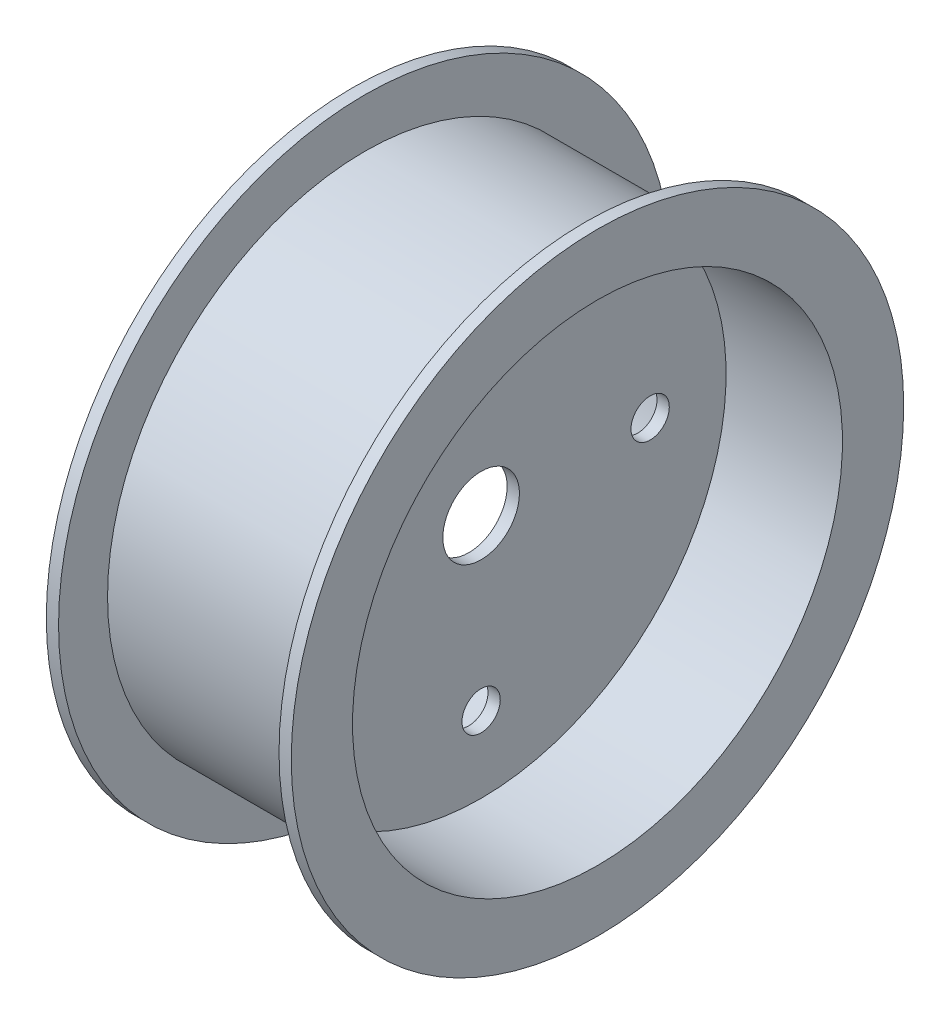
ISO-10303-21;
HEADER;
FILE_DESCRIPTION(('STEP AP214'),'2;1');
FILE_NAME('part.step','',(''),(''),'','','');
FILE_SCHEMA(('AUTOMOTIVE_DESIGN { 1 0 10303 214 1 1 1 1 }'));
ENDSEC;
DATA;
#1=APPLICATION_CONTEXT('core data for automotive mechanical design processes');
#2=APPLICATION_PROTOCOL_DEFINITION('international standard','automotive_design',2000,#1);
#3=PRODUCT_CONTEXT('',#1,'mechanical');
#4=PRODUCT('Part','Part','',(#3));
#5=PRODUCT_RELATED_PRODUCT_CATEGORY('part','',(#4));
#6=PRODUCT_DEFINITION_FORMATION('','',#4);
#7=PRODUCT_DEFINITION_CONTEXT('part definition',#1,'design');
#8=PRODUCT_DEFINITION('design','',#6,#7);
#9=PRODUCT_DEFINITION_SHAPE('','',#8);
#10=(LENGTH_UNIT() NAMED_UNIT(*) SI_UNIT(.MILLI.,.METRE.));
#11=(NAMED_UNIT(*) PLANE_ANGLE_UNIT() SI_UNIT($,.RADIAN.));
#12=(NAMED_UNIT(*) SI_UNIT($,.STERADIAN.) SOLID_ANGLE_UNIT());
#13=UNCERTAINTY_MEASURE_WITH_UNIT(LENGTH_MEASURE(1.E-05),#10,'distance_accuracy_value','');
#14=(GEOMETRIC_REPRESENTATION_CONTEXT(3) GLOBAL_UNCERTAINTY_ASSIGNED_CONTEXT((#13)) GLOBAL_UNIT_ASSIGNED_CONTEXT((#10,
#11,#12)) REPRESENTATION_CONTEXT('',''));
#15=CARTESIAN_POINT('',(0.,0.,0.));
#16=DIRECTION('',(0.,0.,1.));
#17=DIRECTION('',(1.,0.,0.));
#18=AXIS2_PLACEMENT_3D('',#15,#16,#17);
#19=CARTESIAN_POINT('',(-1.27,0.,0.));
#20=DIRECTION('',(-1.,0.,0.));
#21=DIRECTION('',(0.,-1.,0.));
#22=AXIS2_PLACEMENT_3D('',#19,#20,#21);
#23=PLANE('',#22);
#24=CARTESIAN_POINT('',(-1.27,0.,35.052));
#25=DIRECTION('',(-1.,0.,0.));
#26=DIRECTION('',(0.,-1.,0.));
#27=AXIS2_PLACEMENT_3D('',#24,#25,#26);
#28=CIRCLE('',#27,3.96875000000036);
#29=CARTESIAN_POINT('',(-1.27,-3.96875000000036,35.052));
#30=VERTEX_POINT('',#29);
#31=EDGE_CURVE('E93',#30,#30,#28,.F.);
#32=ORIENTED_EDGE('',*,*,#31,.T.);
#33=EDGE_LOOP('',(#32));
#34=FACE_BOUND('',#33,.T.);
#35=CARTESIAN_POINT('',(-1.26999999999999,-35.052,0.));
#36=DIRECTION('',(-1.,0.,0.));
#37=DIRECTION('',(0.,-1.,0.));
#38=AXIS2_PLACEMENT_3D('',#35,#36,#37);
#39=CIRCLE('',#38,3.96875000000023);
#40=CARTESIAN_POINT('',(-1.26999999999999,-39.0207500000002,0.));
#41=VERTEX_POINT('',#40);
#42=EDGE_CURVE('E87',#41,#41,#39,.F.);
#43=ORIENTED_EDGE('',*,*,#42,.T.);
#44=EDGE_LOOP('',(#43));
#45=FACE_BOUND('',#44,.T.);
#46=CARTESIAN_POINT('',(-1.27,0.,-35.052));
#47=DIRECTION('',(-1.,0.,0.));
#48=DIRECTION('',(0.,-1.,0.));
#49=AXIS2_PLACEMENT_3D('',#46,#47,#48);
#50=CIRCLE('',#49,3.96875000000012);
#51=CARTESIAN_POINT('',(-1.27,-3.96875000000012,-35.052));
#52=VERTEX_POINT('',#51);
#53=EDGE_CURVE('E81',#52,#52,#50,.F.);
#54=ORIENTED_EDGE('',*,*,#53,.T.);
#55=EDGE_LOOP('',(#54));
#56=FACE_BOUND('',#55,.T.);
#57=CARTESIAN_POINT('',(-1.27,35.052,0.));
#58=DIRECTION('',(-1.,0.,0.));
#59=DIRECTION('',(0.,-1.,0.));
#60=AXIS2_PLACEMENT_3D('',#57,#58,#59);
#61=CIRCLE('',#60,3.96875);
#62=CARTESIAN_POINT('',(-1.27,31.08325,0.));
#63=VERTEX_POINT('',#62);
#64=EDGE_CURVE('E75',#63,#63,#61,.F.);
#65=ORIENTED_EDGE('',*,*,#64,.T.);
#66=EDGE_LOOP('',(#65));
#67=FACE_BOUND('',#66,.T.);
#68=CARTESIAN_POINT('',(-1.27,0.,0.));
#69=DIRECTION('',(-1.,0.,0.));
#70=DIRECTION('',(0.,-1.,0.));
#71=AXIS2_PLACEMENT_3D('',#68,#69,#70);
#72=CIRCLE('',#71,7.9375);
#73=CARTESIAN_POINT('',(-1.27,-7.9375,0.));
#74=VERTEX_POINT('',#73);
#75=EDGE_CURVE('E69',#74,#74,#72,.F.);
#76=ORIENTED_EDGE('',*,*,#75,.T.);
#77=EDGE_LOOP('',(#76));
#78=FACE_BOUND('',#77,.T.);
#79=CARTESIAN_POINT('',(-1.26999999999999,0.,0.));
#80=DIRECTION('',(1.,0.,0.));
#81=DIRECTION('',(0.,1.,0.));
#82=AXIS2_PLACEMENT_3D('',#79,#80,#81);
#83=CIRCLE('',#82,50.8);
#84=CARTESIAN_POINT('',(-1.27,50.8,0.));
#85=VERTEX_POINT('',#84);
#86=EDGE_CURVE('E10',#85,#85,#83,.T.);
#87=ORIENTED_EDGE('',*,*,#86,.F.);
#88=EDGE_LOOP('',(#87));
#89=FACE_BOUND('',#88,.T.);
#90=ADVANCED_FACE('F31',(#34,#45,#56,#67,#78,#89),#23,.T.);
#91=CARTESIAN_POINT('',(0.,0.,0.));
#92=DIRECTION('',(1.,0.,0.));
#93=DIRECTION('',(0.,1.,0.));
#94=AXIS2_PLACEMENT_3D('',#91,#92,#93);
#95=CYLINDRICAL_SURFACE('',#94,50.8);
#96=ORIENTED_EDGE('',*,*,#86,.T.);
#97=EDGE_LOOP('',(#96));
#98=FACE_BOUND('',#97,.T.);
#99=CARTESIAN_POINT('',(-25.4,0.,0.));
#100=DIRECTION('',(1.,0.,0.));
#101=DIRECTION('',(0.,1.,0.));
#102=AXIS2_PLACEMENT_3D('',#99,#100,#101);
#103=CIRCLE('',#102,50.8);
#104=CARTESIAN_POINT('',(-25.4,50.8,0.));
#105=VERTEX_POINT('',#104);
#106=EDGE_CURVE('E37',#105,#105,#103,.T.);
#107=ORIENTED_EDGE('',*,*,#106,.F.);
#108=EDGE_LOOP('',(#107));
#109=FACE_BOUND('',#108,.T.);
#110=ADVANCED_FACE('F152',(#98,#109),#95,.F.);
#111=CARTESIAN_POINT('',(-25.4,50.8,0.));
#112=DIRECTION('',(-1.,0.,0.));
#113=DIRECTION('',(0.,-1.,0.));
#114=AXIS2_PLACEMENT_3D('',#111,#112,#113);
#115=PLANE('',#114);
#116=ORIENTED_EDGE('',*,*,#106,.T.);
#117=EDGE_LOOP('',(#116));
#118=FACE_BOUND('',#117,.T.);
#119=CARTESIAN_POINT('',(-25.4,0.,0.));
#120=DIRECTION('',(1.,0.,0.));
#121=DIRECTION('',(0.,1.,0.));
#122=AXIS2_PLACEMENT_3D('',#119,#120,#121);
#123=CIRCLE('',#122,63.5);
#124=CARTESIAN_POINT('',(-25.4,63.5,0.));
#125=VERTEX_POINT('',#124);
#126=EDGE_CURVE('E41',#125,#125,#123,.T.);
#127=ORIENTED_EDGE('',*,*,#126,.F.);
#128=EDGE_LOOP('',(#127));
#129=FACE_BOUND('',#128,.T.);
#130=ADVANCED_FACE('F157',(#118,#129),#115,.T.);
#131=CARTESIAN_POINT('',(0.,0.,0.));
#132=DIRECTION('',(1.,0.,0.));
#133=DIRECTION('',(0.,1.,0.));
#134=AXIS2_PLACEMENT_3D('',#131,#132,#133);
#135=CYLINDRICAL_SURFACE('',#134,63.5);
#136=ORIENTED_EDGE('',*,*,#126,.T.);
#137=EDGE_LOOP('',(#136));
#138=FACE_BOUND('',#137,.T.);
#139=CARTESIAN_POINT('',(-22.86,0.,0.));
#140=DIRECTION('',(1.,0.,0.));
#141=DIRECTION('',(0.,1.,0.));
#142=AXIS2_PLACEMENT_3D('',#139,#140,#141);
#143=CIRCLE('',#142,63.5);
#144=CARTESIAN_POINT('',(-22.86,63.5,0.));
#145=VERTEX_POINT('',#144);
#146=EDGE_CURVE('E45',#145,#145,#143,.T.);
#147=ORIENTED_EDGE('',*,*,#146,.F.);
#148=EDGE_LOOP('',(#147));
#149=FACE_BOUND('',#148,.T.);
#150=ADVANCED_FACE('F148',(#138,#149),#135,.T.);
#151=CARTESIAN_POINT('',(-22.86,63.5,0.));
#152=DIRECTION('',(1.,0.,0.));
#153=DIRECTION('',(0.,1.,0.));
#154=AXIS2_PLACEMENT_3D('',#151,#152,#153);
#155=PLANE('',#154);
#156=ORIENTED_EDGE('',*,*,#146,.T.);
#157=EDGE_LOOP('',(#156));
#158=FACE_BOUND('',#157,.T.);
#159=CARTESIAN_POINT('',(-22.86,0.,0.));
#160=DIRECTION('',(1.,0.,0.));
#161=DIRECTION('',(0.,1.,0.));
#162=AXIS2_PLACEMENT_3D('',#159,#160,#161);
#163=CIRCLE('',#162,53.34);
#164=CARTESIAN_POINT('',(-22.86,53.34,0.));
#165=VERTEX_POINT('',#164);
#166=EDGE_CURVE('E50',#165,#165,#163,.T.);
#167=ORIENTED_EDGE('',*,*,#166,.F.);
#168=EDGE_LOOP('',(#167));
#169=FACE_BOUND('',#168,.T.);
#170=ADVANCED_FACE('F142',(#158,#169),#155,.T.);
#171=CARTESIAN_POINT('',(0.,0.,0.));
#172=DIRECTION('',(1.,0.,0.));
#173=DIRECTION('',(0.,1.,0.));
#174=AXIS2_PLACEMENT_3D('',#171,#172,#173);
#175=CYLINDRICAL_SURFACE('',#174,53.34);
#176=ORIENTED_EDGE('',*,*,#166,.T.);
#177=EDGE_LOOP('',(#176));
#178=FACE_BOUND('',#177,.T.);
#179=CARTESIAN_POINT('',(22.86,0.,0.));
#180=DIRECTION('',(1.,0.,0.));
#181=DIRECTION('',(0.,1.,0.));
#182=AXIS2_PLACEMENT_3D('',#179,#180,#181);
#183=CIRCLE('',#182,53.34);
#184=CARTESIAN_POINT('',(22.86,53.34,0.));
#185=VERTEX_POINT('',#184);
#186=EDGE_CURVE('E65',#185,#185,#183,.T.);
#187=ORIENTED_EDGE('',*,*,#186,.F.);
#188=EDGE_LOOP('',(#187));
#189=FACE_BOUND('',#188,.T.);
#190=ADVANCED_FACE('F105',(#178,#189),#175,.T.);
#191=CARTESIAN_POINT('',(1.27,0.,0.));
#192=DIRECTION('',(1.,0.,0.));
#193=DIRECTION('',(0.,-1.,0.));
#194=AXIS2_PLACEMENT_3D('',#191,#192,#193);
#195=PLANE('',#194);
#196=CARTESIAN_POINT('',(1.27,0.,35.052));
#197=DIRECTION('',(1.,0.,0.));
#198=DIRECTION('',(0.,1.,0.));
#199=AXIS2_PLACEMENT_3D('',#196,#197,#198);
#200=CIRCLE('',#199,3.96875000000036);
#201=CARTESIAN_POINT('',(1.27,3.96875000000035,35.052));
#202=VERTEX_POINT('',#201);
#203=EDGE_CURVE('E90',#202,#202,#200,.T.);
#204=ORIENTED_EDGE('',*,*,#203,.F.);
#205=EDGE_LOOP('',(#204));
#206=FACE_BOUND('',#205,.T.);
#207=CARTESIAN_POINT('',(1.26999999999999,-35.052,0.));
#208=DIRECTION('',(1.,0.,0.));
#209=DIRECTION('',(0.,1.,0.));
#210=AXIS2_PLACEMENT_3D('',#207,#208,#209);
#211=CIRCLE('',#210,3.96875000000023);
#212=CARTESIAN_POINT('',(1.26999999999999,-31.0832499999998,0.));
#213=VERTEX_POINT('',#212);
#214=EDGE_CURVE('E84',#213,#213,#211,.T.);
#215=ORIENTED_EDGE('',*,*,#214,.F.);
#216=EDGE_LOOP('',(#215));
#217=FACE_BOUND('',#216,.T.);
#218=CARTESIAN_POINT('',(1.27,0.,-35.052));
#219=DIRECTION('',(1.,0.,0.));
#220=DIRECTION('',(0.,1.,0.));
#221=AXIS2_PLACEMENT_3D('',#218,#219,#220);
#222=CIRCLE('',#221,3.96875000000012);
#223=CARTESIAN_POINT('',(1.27,3.96875000000012,-35.052));
#224=VERTEX_POINT('',#223);
#225=EDGE_CURVE('E78',#224,#224,#222,.T.);
#226=ORIENTED_EDGE('',*,*,#225,.F.);
#227=EDGE_LOOP('',(#226));
#228=FACE_BOUND('',#227,.T.);
#229=CARTESIAN_POINT('',(1.27,35.052,0.));
#230=DIRECTION('',(1.,0.,0.));
#231=DIRECTION('',(0.,1.,0.));
#232=AXIS2_PLACEMENT_3D('',#229,#230,#231);
#233=CIRCLE('',#232,3.96875);
#234=CARTESIAN_POINT('',(1.27,39.02075,0.));
#235=VERTEX_POINT('',#234);
#236=EDGE_CURVE('E72',#235,#235,#233,.T.);
#237=ORIENTED_EDGE('',*,*,#236,.F.);
#238=EDGE_LOOP('',(#237));
#239=FACE_BOUND('',#238,.T.);
#240=CARTESIAN_POINT('',(1.27,0.,0.));
#241=DIRECTION('',(1.,0.,0.));
#242=DIRECTION('',(0.,1.,0.));
#243=AXIS2_PLACEMENT_3D('',#240,#241,#242);
#244=CIRCLE('',#243,7.9375);
#245=CARTESIAN_POINT('',(1.27,7.9375,0.));
#246=VERTEX_POINT('',#245);
#247=EDGE_CURVE('E68',#246,#246,#244,.T.);
#248=ORIENTED_EDGE('',*,*,#247,.F.);
#249=EDGE_LOOP('',(#248));
#250=FACE_BOUND('',#249,.T.);
#251=CARTESIAN_POINT('',(1.26999999999999,0.,0.));
#252=DIRECTION('',(1.,0.,0.));
#253=DIRECTION('',(0.,1.,0.));
#254=AXIS2_PLACEMENT_3D('',#251,#252,#253);
#255=CIRCLE('',#254,50.8);
#256=CARTESIAN_POINT('',(1.27,50.8,0.));
#257=VERTEX_POINT('',#256);
#258=EDGE_CURVE('E53',#257,#257,#255,.T.);
#259=ORIENTED_EDGE('',*,*,#258,.T.);
#260=EDGE_LOOP('',(#259));
#261=FACE_BOUND('',#260,.T.);
#262=ADVANCED_FACE('F101',(#206,#217,#228,#239,#250,#261),#195,.T.);
#263=CARTESIAN_POINT('',(0.,0.,0.));
#264=DIRECTION('',(-1.,0.,0.));
#265=DIRECTION('',(0.,1.,0.));
#266=AXIS2_PLACEMENT_3D('',#263,#264,#265);
#267=CYLINDRICAL_SURFACE('',#266,50.8);
#268=ORIENTED_EDGE('',*,*,#258,.F.);
#269=EDGE_LOOP('',(#268));
#270=FACE_BOUND('',#269,.T.);
#271=CARTESIAN_POINT('',(25.4,0.,0.));
#272=DIRECTION('',(1.,0.,0.));
#273=DIRECTION('',(0.,1.,0.));
#274=AXIS2_PLACEMENT_3D('',#271,#272,#273);
#275=CIRCLE('',#274,50.8);
#276=CARTESIAN_POINT('',(25.4,50.8,0.));
#277=VERTEX_POINT('',#276);
#278=EDGE_CURVE('E56',#277,#277,#275,.T.);
#279=ORIENTED_EDGE('',*,*,#278,.T.);
#280=EDGE_LOOP('',(#279));
#281=FACE_BOUND('',#280,.T.);
#282=ADVANCED_FACE('F104',(#270,#281),#267,.F.);
#283=CARTESIAN_POINT('',(25.4,50.8,0.));
#284=DIRECTION('',(1.,0.,0.));
#285=DIRECTION('',(0.,-1.,0.));
#286=AXIS2_PLACEMENT_3D('',#283,#284,#285);
#287=PLANE('',#286);
#288=ORIENTED_EDGE('',*,*,#278,.F.);
#289=EDGE_LOOP('',(#288));
#290=FACE_BOUND('',#289,.T.);
#291=CARTESIAN_POINT('',(25.4,0.,0.));
#292=DIRECTION('',(1.,0.,0.));
#293=DIRECTION('',(0.,1.,0.));
#294=AXIS2_PLACEMENT_3D('',#291,#292,#293);
#295=CIRCLE('',#294,63.5);
#296=CARTESIAN_POINT('',(25.4,63.5,0.));
#297=VERTEX_POINT('',#296);
#298=EDGE_CURVE('E59',#297,#297,#295,.T.);
#299=ORIENTED_EDGE('',*,*,#298,.T.);
#300=EDGE_LOOP('',(#299));
#301=FACE_BOUND('',#300,.T.);
#302=ADVANCED_FACE('F119',(#290,#301),#287,.T.);
#303=CARTESIAN_POINT('',(0.,0.,0.));
#304=DIRECTION('',(-1.,0.,0.));
#305=DIRECTION('',(0.,1.,0.));
#306=AXIS2_PLACEMENT_3D('',#303,#304,#305);
#307=CYLINDRICAL_SURFACE('',#306,63.5);
#308=ORIENTED_EDGE('',*,*,#298,.F.);
#309=EDGE_LOOP('',(#308));
#310=FACE_BOUND('',#309,.T.);
#311=CARTESIAN_POINT('',(22.86,0.,0.));
#312=DIRECTION('',(1.,0.,0.));
#313=DIRECTION('',(0.,1.,0.));
#314=AXIS2_PLACEMENT_3D('',#311,#312,#313);
#315=CIRCLE('',#314,63.5);
#316=CARTESIAN_POINT('',(22.86,63.5,0.));
#317=VERTEX_POINT('',#316);
#318=EDGE_CURVE('E62',#317,#317,#315,.T.);
#319=ORIENTED_EDGE('',*,*,#318,.T.);
#320=EDGE_LOOP('',(#319));
#321=FACE_BOUND('',#320,.T.);
#322=ADVANCED_FACE('F125',(#310,#321),#307,.T.);
#323=CARTESIAN_POINT('',(22.86,63.5,0.));
#324=DIRECTION('',(-1.,0.,0.));
#325=DIRECTION('',(0.,1.,0.));
#326=AXIS2_PLACEMENT_3D('',#323,#324,#325);
#327=PLANE('',#326);
#328=ORIENTED_EDGE('',*,*,#318,.F.);
#329=EDGE_LOOP('',(#328));
#330=FACE_BOUND('',#329,.T.);
#331=ORIENTED_EDGE('',*,*,#186,.T.);
#332=EDGE_LOOP('',(#331));
#333=FACE_BOUND('',#332,.T.);
#334=ADVANCED_FACE('F131',(#330,#333),#327,.T.);
#335=CARTESIAN_POINT('',(-25.401,0.,0.));
#336=DIRECTION('',(1.,0.,0.));
#337=DIRECTION('',(0.,1.,0.));
#338=AXIS2_PLACEMENT_3D('',#335,#336,#337);
#339=CYLINDRICAL_SURFACE('',#338,7.9375);
#340=ORIENTED_EDGE('',*,*,#75,.F.);
#341=EDGE_LOOP('',(#340));
#342=FACE_BOUND('',#341,.T.);
#343=ORIENTED_EDGE('',*,*,#247,.T.);
#344=EDGE_LOOP('',(#343));
#345=FACE_BOUND('',#344,.T.);
#346=ADVANCED_FACE('F137',(#342,#345),#339,.F.);
#347=CARTESIAN_POINT('',(-25.401,35.052,0.));
#348=DIRECTION('',(1.,0.,0.));
#349=DIRECTION('',(0.,1.,0.));
#350=AXIS2_PLACEMENT_3D('',#347,#348,#349);
#351=CYLINDRICAL_SURFACE('',#350,3.96875);
#352=ORIENTED_EDGE('',*,*,#64,.F.);
#353=EDGE_LOOP('',(#352));
#354=FACE_BOUND('',#353,.T.);
#355=ORIENTED_EDGE('',*,*,#236,.T.);
#356=EDGE_LOOP('',(#355));
#357=FACE_BOUND('',#356,.T.);
#358=ADVANCED_FACE('F171',(#354,#357),#351,.F.);
#359=CARTESIAN_POINT('',(-25.401,0.,-35.052));
#360=DIRECTION('',(1.,0.,0.));
#361=DIRECTION('',(0.,1.,0.));
#362=AXIS2_PLACEMENT_3D('',#359,#360,#361);
#363=CYLINDRICAL_SURFACE('',#362,3.96875000000012);
#364=ORIENTED_EDGE('',*,*,#53,.F.);
#365=EDGE_LOOP('',(#364));
#366=FACE_BOUND('',#365,.T.);
#367=ORIENTED_EDGE('',*,*,#225,.T.);
#368=EDGE_LOOP('',(#367));
#369=FACE_BOUND('',#368,.T.);
#370=ADVANCED_FACE('F176',(#366,#369),#363,.F.);
#371=CARTESIAN_POINT('',(-25.401,-35.052,0.));
#372=DIRECTION('',(1.,0.,0.));
#373=DIRECTION('',(0.,1.,0.));
#374=AXIS2_PLACEMENT_3D('',#371,#372,#373);
#375=CYLINDRICAL_SURFACE('',#374,3.96875000000023);
#376=ORIENTED_EDGE('',*,*,#42,.F.);
#377=EDGE_LOOP('',(#376));
#378=FACE_BOUND('',#377,.T.);
#379=ORIENTED_EDGE('',*,*,#214,.T.);
#380=EDGE_LOOP('',(#379));
#381=FACE_BOUND('',#380,.T.);
#382=ADVANCED_FACE('F182',(#378,#381),#375,.F.);
#383=CARTESIAN_POINT('',(-25.401,0.,35.052));
#384=DIRECTION('',(1.,0.,0.));
#385=DIRECTION('',(0.,1.,0.));
#386=AXIS2_PLACEMENT_3D('',#383,#384,#385);
#387=CYLINDRICAL_SURFACE('',#386,3.96875000000036);
#388=ORIENTED_EDGE('',*,*,#31,.F.);
#389=EDGE_LOOP('',(#388));
#390=FACE_BOUND('',#389,.T.);
#391=ORIENTED_EDGE('',*,*,#203,.T.);
#392=EDGE_LOOP('',(#391));
#393=FACE_BOUND('',#392,.T.);
#394=ADVANCED_FACE('F99',(#390,#393),#387,.F.);
#395=CLOSED_SHELL('',(#90,#110,#130,#150,#170,#190,#262,#282,#302,#322,#334,#346,#358,#370,#382,#394));
#396=MANIFOLD_SOLID_BREP('B2',#395);
#397=ADVANCED_BREP_SHAPE_REPRESENTATION('',(#18,#396),#14);
#398=SHAPE_DEFINITION_REPRESENTATION(#9,#397);
ENDSEC;
END-ISO-10303-21;
